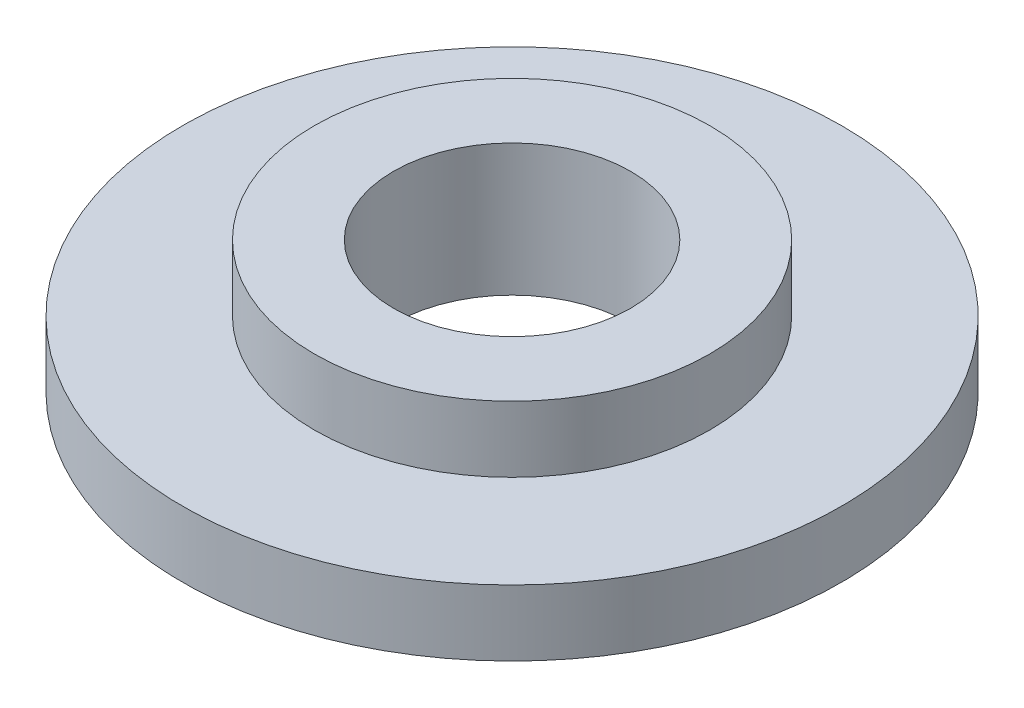
ISO-10303-21;
HEADER;
FILE_DESCRIPTION(('STEP AP214'),'2;1');
FILE_NAME('part.step','',(''),(''),'','','');
FILE_SCHEMA(('AUTOMOTIVE_DESIGN { 1 0 10303 214 1 1 1 1 }'));
ENDSEC;
DATA;
#1=APPLICATION_CONTEXT('core data for automotive mechanical design processes');
#2=APPLICATION_PROTOCOL_DEFINITION('international standard','automotive_design',2000,#1);
#3=PRODUCT_CONTEXT('',#1,'mechanical');
#4=PRODUCT('Part','Part','',(#3));
#5=PRODUCT_RELATED_PRODUCT_CATEGORY('part','',(#4));
#6=PRODUCT_DEFINITION_FORMATION('','',#4);
#7=PRODUCT_DEFINITION_CONTEXT('part definition',#1,'design');
#8=PRODUCT_DEFINITION('design','',#6,#7);
#9=PRODUCT_DEFINITION_SHAPE('','',#8);
#10=(LENGTH_UNIT() NAMED_UNIT(*) SI_UNIT(.MILLI.,.METRE.));
#11=(NAMED_UNIT(*) PLANE_ANGLE_UNIT() SI_UNIT($,.RADIAN.));
#12=(NAMED_UNIT(*) SI_UNIT($,.STERADIAN.) SOLID_ANGLE_UNIT());
#13=UNCERTAINTY_MEASURE_WITH_UNIT(LENGTH_MEASURE(1.E-05),#10,'distance_accuracy_value','');
#14=(GEOMETRIC_REPRESENTATION_CONTEXT(3) GLOBAL_UNCERTAINTY_ASSIGNED_CONTEXT((#13)) GLOBAL_UNIT_ASSIGNED_CONTEXT((#10,
#11,#12)) REPRESENTATION_CONTEXT('',''));
#15=CARTESIAN_POINT('',(0.,0.,0.));
#16=DIRECTION('',(0.,0.,1.));
#17=DIRECTION('',(1.,0.,0.));
#18=AXIS2_PLACEMENT_3D('',#15,#16,#17);
#19=CARTESIAN_POINT('',(0.,1.,0.));
#20=DIRECTION('',(0.,1.,0.));
#21=DIRECTION('',(0.,0.,1.));
#22=AXIS2_PLACEMENT_3D('',#19,#20,#21);
#23=PLANE('',#22);
#24=CARTESIAN_POINT('',(0.,1.,0.));
#25=DIRECTION('',(0.,1.,0.));
#26=DIRECTION('',(0.,0.,1.));
#27=AXIS2_PLACEMENT_3D('',#24,#25,#26);
#28=CIRCLE('',#27,3.);
#29=CARTESIAN_POINT('',(0.,1.,3.));
#30=VERTEX_POINT('',#29);
#31=EDGE_CURVE('E10',#30,#30,#28,.T.);
#32=ORIENTED_EDGE('',*,*,#31,.T.);
#33=EDGE_LOOP('',(#32));
#34=FACE_BOUND('',#33,.T.);
#35=CARTESIAN_POINT('',(0.,1.,0.));
#36=DIRECTION('',(0.,1.,0.));
#37=DIRECTION('',(0.,0.,1.));
#38=AXIS2_PLACEMENT_3D('',#35,#36,#37);
#39=CIRCLE('',#38,1.8);
#40=CARTESIAN_POINT('',(0.,1.,1.8));
#41=VERTEX_POINT('',#40);
#42=EDGE_CURVE('E38',#41,#41,#39,.T.);
#43=ORIENTED_EDGE('',*,*,#42,.F.);
#44=EDGE_LOOP('',(#43));
#45=FACE_BOUND('',#44,.T.);
#46=ADVANCED_FACE('F31',(#34,#45),#23,.T.);
#47=CARTESIAN_POINT('',(0.,1.,0.));
#48=DIRECTION('',(0.,-1.,0.));
#49=DIRECTION('',(0.,0.,-1.));
#50=AXIS2_PLACEMENT_3D('',#47,#48,#49);
#51=CYLINDRICAL_SURFACE('',#50,3.);
#52=ORIENTED_EDGE('',*,*,#31,.F.);
#53=EDGE_LOOP('',(#52));
#54=FACE_BOUND('',#53,.T.);
#55=CARTESIAN_POINT('',(0.,0.,0.));
#56=DIRECTION('',(0.,-1.,0.));
#57=DIRECTION('',(0.,0.,-1.));
#58=AXIS2_PLACEMENT_3D('',#55,#56,#57);
#59=CIRCLE('',#58,3.);
#60=CARTESIAN_POINT('',(0.,0.,-3.));
#61=VERTEX_POINT('',#60);
#62=EDGE_CURVE('E42',#61,#61,#59,.T.);
#63=ORIENTED_EDGE('',*,*,#62,.F.);
#64=EDGE_LOOP('',(#63));
#65=FACE_BOUND('',#64,.T.);
#66=ADVANCED_FACE('F33',(#54,#65),#51,.T.);
#67=CARTESIAN_POINT('',(0.,1.,0.));
#68=DIRECTION('',(0.,-1.,0.));
#69=DIRECTION('',(0.,0.,-1.));
#70=AXIS2_PLACEMENT_3D('',#67,#68,#69);
#71=CYLINDRICAL_SURFACE('',#70,1.8);
#72=ORIENTED_EDGE('',*,*,#42,.T.);
#73=EDGE_LOOP('',(#72));
#74=FACE_BOUND('',#73,.T.);
#75=CARTESIAN_POINT('',(0.,-1.,0.));
#76=DIRECTION('',(0.,-1.,0.));
#77=DIRECTION('',(0.,0.,-1.));
#78=AXIS2_PLACEMENT_3D('',#75,#76,#77);
#79=CIRCLE('',#78,1.8);
#80=CARTESIAN_POINT('',(0.,-1.,-1.8));
#81=VERTEX_POINT('',#80);
#82=EDGE_CURVE('E52',#81,#81,#79,.T.);
#83=ORIENTED_EDGE('',*,*,#82,.T.);
#84=EDGE_LOOP('',(#83));
#85=FACE_BOUND('',#84,.T.);
#86=ADVANCED_FACE('F58',(#74,#85),#71,.F.);
#87=CARTESIAN_POINT('',(0.,0.,0.));
#88=DIRECTION('',(0.,-1.,0.));
#89=DIRECTION('',(0.,0.,-1.));
#90=AXIS2_PLACEMENT_3D('',#87,#88,#89);
#91=PLANE('',#90);
#92=CARTESIAN_POINT('',(0.,0.,0.));
#93=DIRECTION('',(0.,-1.,0.));
#94=DIRECTION('',(0.,0.,-1.));
#95=AXIS2_PLACEMENT_3D('',#92,#93,#94);
#96=CIRCLE('',#95,5.);
#97=CARTESIAN_POINT('',(0.,0.,-5.));
#98=VERTEX_POINT('',#97);
#99=EDGE_CURVE('E49',#98,#98,#96,.T.);
#100=ORIENTED_EDGE('',*,*,#99,.F.);
#101=EDGE_LOOP('',(#100));
#102=FACE_BOUND('',#101,.T.);
#103=ORIENTED_EDGE('',*,*,#62,.T.);
#104=EDGE_LOOP('',(#103));
#105=FACE_BOUND('',#104,.T.);
#106=ADVANCED_FACE('F63',(#102,#105),#91,.F.);
#107=CARTESIAN_POINT('',(0.,-1.,0.));
#108=DIRECTION('',(0.,-1.,0.));
#109=DIRECTION('',(0.,0.,-1.));
#110=AXIS2_PLACEMENT_3D('',#107,#108,#109);
#111=PLANE('',#110);
#112=CARTESIAN_POINT('',(0.,-1.,0.));
#113=DIRECTION('',(0.,-1.,0.));
#114=DIRECTION('',(0.,0.,-1.));
#115=AXIS2_PLACEMENT_3D('',#112,#113,#114);
#116=CIRCLE('',#115,5.);
#117=CARTESIAN_POINT('',(0.,-1.,-5.));
#118=VERTEX_POINT('',#117);
#119=EDGE_CURVE('E46',#118,#118,#116,.T.);
#120=ORIENTED_EDGE('',*,*,#119,.T.);
#121=EDGE_LOOP('',(#120));
#122=FACE_BOUND('',#121,.T.);
#123=ORIENTED_EDGE('',*,*,#82,.F.);
#124=EDGE_LOOP('',(#123));
#125=FACE_BOUND('',#124,.T.);
#126=ADVANCED_FACE('F60',(#122,#125),#111,.T.);
#127=CARTESIAN_POINT('',(0.,-1.,0.));
#128=DIRECTION('',(0.,1.,0.));
#129=DIRECTION('',(0.,0.,1.));
#130=AXIS2_PLACEMENT_3D('',#127,#128,#129);
#131=CYLINDRICAL_SURFACE('',#130,5.);
#132=ORIENTED_EDGE('',*,*,#119,.F.);
#133=EDGE_LOOP('',(#132));
#134=FACE_BOUND('',#133,.T.);
#135=ORIENTED_EDGE('',*,*,#99,.T.);
#136=EDGE_LOOP('',(#135));
#137=FACE_BOUND('',#136,.T.);
#138=ADVANCED_FACE('F62',(#134,#137),#131,.T.);
#139=CLOSED_SHELL('',(#46,#66,#86,#106,#126,#138));
#140=MANIFOLD_SOLID_BREP('B2',#139);
#141=ADVANCED_BREP_SHAPE_REPRESENTATION('',(#18,#140),#14);
#142=SHAPE_DEFINITION_REPRESENTATION(#9,#141);
ENDSEC;
END-ISO-10303-21;
